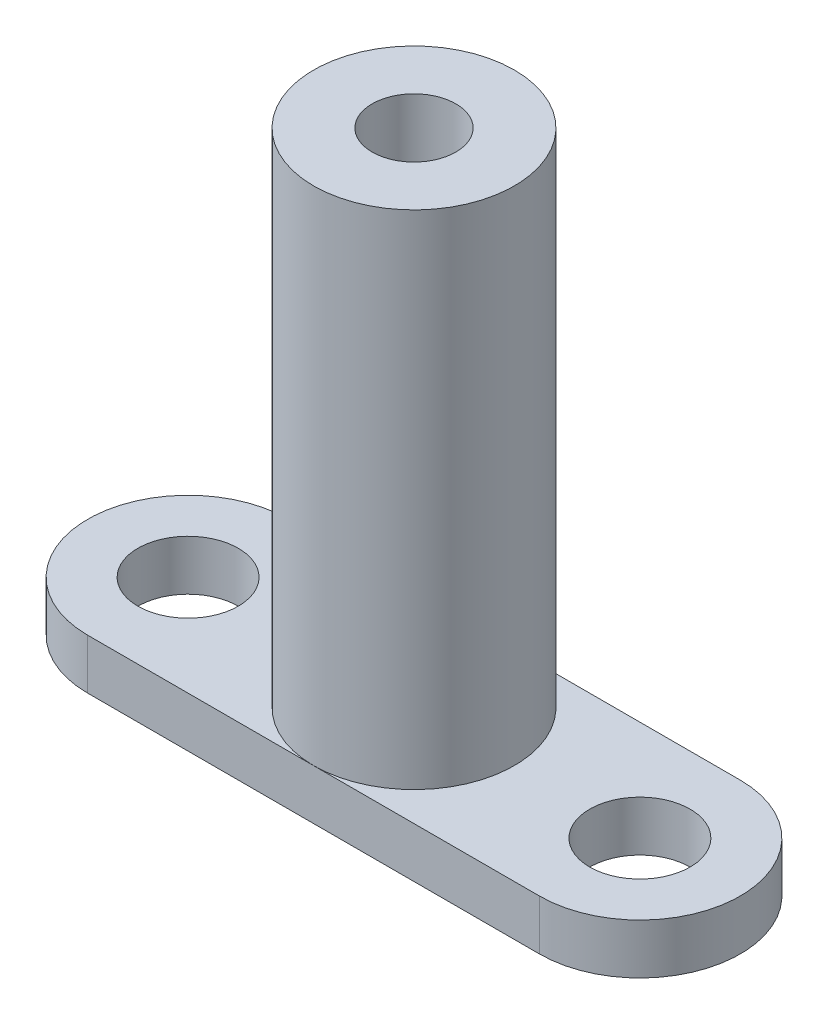
ISO-10303-21;
HEADER;
FILE_DESCRIPTION(('STEP AP214'),'2;1');
FILE_NAME('part.step','',(''),(''),'','','');
FILE_SCHEMA(('AUTOMOTIVE_DESIGN { 1 0 10303 214 1 1 1 1 }'));
ENDSEC;
DATA;
#1=APPLICATION_CONTEXT('core data for automotive mechanical design processes');
#2=APPLICATION_PROTOCOL_DEFINITION('international standard','automotive_design',2000,#1);
#3=PRODUCT_CONTEXT('',#1,'mechanical');
#4=PRODUCT('Part','Part','',(#3));
#5=PRODUCT_RELATED_PRODUCT_CATEGORY('part','',(#4));
#6=PRODUCT_DEFINITION_FORMATION('','',#4);
#7=PRODUCT_DEFINITION_CONTEXT('part definition',#1,'design');
#8=PRODUCT_DEFINITION('design','',#6,#7);
#9=PRODUCT_DEFINITION_SHAPE('','',#8);
#10=(LENGTH_UNIT() NAMED_UNIT(*) SI_UNIT(.MILLI.,.METRE.));
#11=(NAMED_UNIT(*) PLANE_ANGLE_UNIT() SI_UNIT($,.RADIAN.));
#12=(NAMED_UNIT(*) SI_UNIT($,.STERADIAN.) SOLID_ANGLE_UNIT());
#13=UNCERTAINTY_MEASURE_WITH_UNIT(LENGTH_MEASURE(1.E-05),#10,'distance_accuracy_value','');
#14=(GEOMETRIC_REPRESENTATION_CONTEXT(3) GLOBAL_UNCERTAINTY_ASSIGNED_CONTEXT((#13)) GLOBAL_UNIT_ASSIGNED_CONTEXT((#10,
#11,#12)) REPRESENTATION_CONTEXT('',''));
#15=CARTESIAN_POINT('',(0.,0.,0.));
#16=DIRECTION('',(0.,0.,1.));
#17=DIRECTION('',(1.,0.,0.));
#18=AXIS2_PLACEMENT_3D('',#15,#16,#17);
#19=CARTESIAN_POINT('',(0.,3.,0.));
#20=DIRECTION('',(0.,1.,0.));
#21=DIRECTION('',(0.,0.,1.));
#22=AXIS2_PLACEMENT_3D('',#19,#20,#21);
#23=PLANE('',#22);
#24=CARTESIAN_POINT('',(13.5,3.,0.));
#25=DIRECTION('',(0.,1.,0.));
#26=DIRECTION('',(0.,0.,1.));
#27=AXIS2_PLACEMENT_3D('',#24,#25,#26);
#28=CIRCLE('',#27,3.);
#29=CARTESIAN_POINT('',(13.5,3.,3.));
#30=VERTEX_POINT('',#29);
#31=EDGE_CURVE('E151',#30,#30,#28,.T.);
#32=ORIENTED_EDGE('',*,*,#31,.F.);
#33=EDGE_LOOP('',(#32));
#34=FACE_BOUND('',#33,.T.);
#35=CARTESIAN_POINT('',(0.,3.,0.));
#36=DIRECTION('',(0.,1.,0.));
#37=DIRECTION('',(0.,0.,1.));
#38=AXIS2_PLACEMENT_3D('',#35,#36,#37);
#39=CIRCLE('',#38,6.);
#40=CARTESIAN_POINT('',(0.,3.,6.));
#41=VERTEX_POINT('',#40);
#42=CARTESIAN_POINT('',(0.,3.,-6.));
#43=VERTEX_POINT('',#42);
#44=EDGE_CURVE('E52',#41,#43,#39,.T.);
#45=ORIENTED_EDGE('',*,*,#44,.F.);
#46=DIRECTION('',(1.,0.,0.));
#47=VECTOR('',#46,1.);
#48=CARTESIAN_POINT('',(0.,3.,6.));
#49=LINE('',#48,#47);
#50=CARTESIAN_POINT('',(13.5,3.,6.));
#51=VERTEX_POINT('',#50);
#52=EDGE_CURVE('E100',#41,#51,#49,.T.);
#53=ORIENTED_EDGE('',*,*,#52,.T.);
#54=CARTESIAN_POINT('',(13.5,3.,0.));
#55=DIRECTION('',(0.,1.,0.));
#56=DIRECTION('',(0.,0.,1.));
#57=AXIS2_PLACEMENT_3D('',#54,#55,#56);
#58=CIRCLE('',#57,6.);
#59=CARTESIAN_POINT('',(13.5,3.,-6.));
#60=VERTEX_POINT('',#59);
#61=EDGE_CURVE('E99',#51,#60,#58,.T.);
#62=ORIENTED_EDGE('',*,*,#61,.T.);
#63=DIRECTION('',(1.,0.,0.));
#64=VECTOR('',#63,1.);
#65=CARTESIAN_POINT('',(0.,3.,-6.));
#66=LINE('',#65,#64);
#67=EDGE_CURVE('E111',#43,#60,#66,.T.);
#68=ORIENTED_EDGE('',*,*,#67,.F.);
#69=EDGE_LOOP('',(#45,#53,#62,#68));
#70=FACE_BOUND('',#69,.T.);
#71=ADVANCED_FACE('F41',(#34,#70),#23,.T.);
#72=CARTESIAN_POINT('',(-13.5,3.,0.));
#73=DIRECTION('',(0.,-1.,0.));
#74=DIRECTION('',(0.,0.,-1.));
#75=AXIS2_PLACEMENT_3D('',#72,#73,#74);
#76=CYLINDRICAL_SURFACE('',#75,6.);
#77=CARTESIAN_POINT('',(-13.5,0.,0.));
#78=DIRECTION('',(0.,1.,0.));
#79=DIRECTION('',(0.,0.,1.));
#80=AXIS2_PLACEMENT_3D('',#77,#78,#79);
#81=CIRCLE('',#80,6.);
#82=CARTESIAN_POINT('',(-13.5,0.,-6.));
#83=VERTEX_POINT('',#82);
#84=CARTESIAN_POINT('',(-13.5,0.,6.));
#85=VERTEX_POINT('',#84);
#86=EDGE_CURVE('E163',#83,#85,#81,.T.);
#87=ORIENTED_EDGE('',*,*,#86,.T.);
#88=DIRECTION('',(0.,-1.,0.));
#89=VECTOR('',#88,1.);
#90=CARTESIAN_POINT('',(-13.5,3.,6.));
#91=LINE('',#90,#89);
#92=CARTESIAN_POINT('',(-13.5,3.,6.));
#93=VERTEX_POINT('',#92);
#94=EDGE_CURVE('E50',#93,#85,#91,.T.);
#95=ORIENTED_EDGE('',*,*,#94,.F.);
#96=CARTESIAN_POINT('',(-13.5,3.,0.));
#97=DIRECTION('',(0.,1.,0.));
#98=DIRECTION('',(0.,0.,1.));
#99=AXIS2_PLACEMENT_3D('',#96,#97,#98);
#100=CIRCLE('',#99,6.);
#101=CARTESIAN_POINT('',(-13.5,3.,-6.));
#102=VERTEX_POINT('',#101);
#103=EDGE_CURVE('E97',#102,#93,#100,.T.);
#104=ORIENTED_EDGE('',*,*,#103,.F.);
#105=DIRECTION('',(0.,-1.,0.));
#106=VECTOR('',#105,1.);
#107=CARTESIAN_POINT('',(-13.5,3.,-6.));
#108=LINE('',#107,#106);
#109=EDGE_CURVE('E66',#102,#83,#108,.T.);
#110=ORIENTED_EDGE('',*,*,#109,.T.);
#111=EDGE_LOOP('',(#87,#95,#104,#110));
#112=FACE_BOUND('',#111,.T.);
#113=ADVANCED_FACE('F43',(#112),#76,.T.);
#114=CARTESIAN_POINT('',(0.,3.,6.));
#115=DIRECTION('',(0.,0.,-1.));
#116=DIRECTION('',(-1.,0.,0.));
#117=AXIS2_PLACEMENT_3D('',#114,#115,#116);
#118=PLANE('',#117);
#119=DIRECTION('',(1.,0.,0.));
#120=VECTOR('',#119,1.);
#121=CARTESIAN_POINT('',(0.,0.,6.));
#122=LINE('',#121,#120);
#123=CARTESIAN_POINT('',(13.5,0.,6.));
#124=VERTEX_POINT('',#123);
#125=EDGE_CURVE('E171',#85,#124,#122,.T.);
#126=ORIENTED_EDGE('',*,*,#125,.T.);
#127=DIRECTION('',(0.,-1.,0.));
#128=VECTOR('',#127,1.);
#129=CARTESIAN_POINT('',(13.5,3.,6.));
#130=LINE('',#129,#128);
#131=EDGE_CURVE('E106',#51,#124,#130,.T.);
#132=ORIENTED_EDGE('',*,*,#131,.F.);
#133=ORIENTED_EDGE('',*,*,#52,.F.);
#134=EDGE_CURVE('E92',#93,#41,#49,.T.);
#135=ORIENTED_EDGE('',*,*,#134,.F.);
#136=ORIENTED_EDGE('',*,*,#94,.T.);
#137=EDGE_LOOP('',(#126,#132,#133,#135,#136));
#138=FACE_BOUND('',#137,.T.);
#139=ADVANCED_FACE('F104',(#138),#118,.F.);
#140=CARTESIAN_POINT('',(13.5,3.,0.));
#141=DIRECTION('',(0.,-1.,0.));
#142=DIRECTION('',(0.,0.,-1.));
#143=AXIS2_PLACEMENT_3D('',#140,#141,#142);
#144=CYLINDRICAL_SURFACE('',#143,6.);
#145=CARTESIAN_POINT('',(13.5,0.,0.));
#146=DIRECTION('',(0.,1.,0.));
#147=DIRECTION('',(0.,0.,1.));
#148=AXIS2_PLACEMENT_3D('',#145,#146,#147);
#149=CIRCLE('',#148,6.);
#150=CARTESIAN_POINT('',(13.5,0.,-6.));
#151=VERTEX_POINT('',#150);
#152=EDGE_CURVE('E173',#124,#151,#149,.T.);
#153=ORIENTED_EDGE('',*,*,#152,.T.);
#154=DIRECTION('',(0.,-1.,0.));
#155=VECTOR('',#154,1.);
#156=CARTESIAN_POINT('',(13.5,3.,-6.));
#157=LINE('',#156,#155);
#158=EDGE_CURVE('E179',#60,#151,#157,.T.);
#159=ORIENTED_EDGE('',*,*,#158,.F.);
#160=ORIENTED_EDGE('',*,*,#61,.F.);
#161=ORIENTED_EDGE('',*,*,#131,.T.);
#162=EDGE_LOOP('',(#153,#159,#160,#161));
#163=FACE_BOUND('',#162,.T.);
#164=ADVANCED_FACE('F144',(#163),#144,.T.);
#165=CARTESIAN_POINT('',(0.,3.,-6.));
#166=DIRECTION('',(0.,0.,-1.));
#167=DIRECTION('',(-1.,0.,0.));
#168=AXIS2_PLACEMENT_3D('',#165,#166,#167);
#169=PLANE('',#168);
#170=DIRECTION('',(1.,0.,0.));
#171=VECTOR('',#170,1.);
#172=CARTESIAN_POINT('',(0.,0.,-6.));
#173=LINE('',#172,#171);
#174=EDGE_CURVE('E165',#83,#151,#173,.T.);
#175=ORIENTED_EDGE('',*,*,#174,.F.);
#176=ORIENTED_EDGE('',*,*,#109,.F.);
#177=EDGE_CURVE('E168',#102,#43,#66,.T.);
#178=ORIENTED_EDGE('',*,*,#177,.T.);
#179=ORIENTED_EDGE('',*,*,#67,.T.);
#180=ORIENTED_EDGE('',*,*,#158,.T.);
#181=EDGE_LOOP('',(#175,#176,#178,#179,#180));
#182=FACE_BOUND('',#181,.T.);
#183=ADVANCED_FACE('F139',(#182),#169,.T.);
#184=CARTESIAN_POINT('',(-13.5,3.,0.));
#185=DIRECTION('',(0.,1.,0.));
#186=DIRECTION('',(0.,0.,1.));
#187=AXIS2_PLACEMENT_3D('',#184,#185,#186);
#188=CIRCLE('',#187,3.);
#189=CARTESIAN_POINT('',(-13.5,3.,3.));
#190=VERTEX_POINT('',#189);
#191=EDGE_CURVE('E148',#190,#190,#188,.T.);
#192=ORIENTED_EDGE('',*,*,#191,.F.);
#193=EDGE_LOOP('',(#192));
#194=FACE_BOUND('',#193,.T.);
#195=EDGE_CURVE('E11',#43,#41,#39,.T.);
#196=ORIENTED_EDGE('',*,*,#195,.F.);
#197=ORIENTED_EDGE('',*,*,#177,.F.);
#198=ORIENTED_EDGE('',*,*,#103,.T.);
#199=ORIENTED_EDGE('',*,*,#134,.T.);
#200=EDGE_LOOP('',(#196,#197,#198,#199));
#201=FACE_BOUND('',#200,.T.);
#202=ADVANCED_FACE('F96',(#194,#201),#23,.T.);
#203=CARTESIAN_POINT('',(0.,0.,0.));
#204=DIRECTION('',(0.,1.,0.));
#205=DIRECTION('',(0.,0.,1.));
#206=AXIS2_PLACEMENT_3D('',#203,#204,#205);
#207=PLANE('',#206);
#208=CARTESIAN_POINT('',(-13.5,0.,0.));
#209=DIRECTION('',(0.,1.,0.));
#210=DIRECTION('',(0.,0.,1.));
#211=AXIS2_PLACEMENT_3D('',#208,#209,#210);
#212=CIRCLE('',#211,3.);
#213=CARTESIAN_POINT('',(-13.5,0.,3.));
#214=VERTEX_POINT('',#213);
#215=EDGE_CURVE('E45',#214,#214,#212,.T.);
#216=ORIENTED_EDGE('',*,*,#215,.T.);
#217=EDGE_LOOP('',(#216));
#218=FACE_BOUND('',#217,.T.);
#219=CARTESIAN_POINT('',(13.5,0.,0.));
#220=DIRECTION('',(0.,1.,0.));
#221=DIRECTION('',(0.,0.,1.));
#222=AXIS2_PLACEMENT_3D('',#219,#220,#221);
#223=CIRCLE('',#222,3.);
#224=CARTESIAN_POINT('',(13.5,0.,3.));
#225=VERTEX_POINT('',#224);
#226=EDGE_CURVE('E150',#225,#225,#223,.T.);
#227=ORIENTED_EDGE('',*,*,#226,.T.);
#228=EDGE_LOOP('',(#227));
#229=FACE_BOUND('',#228,.T.);
#230=CARTESIAN_POINT('',(0.,0.,0.));
#231=DIRECTION('',(0.,1.,0.));
#232=DIRECTION('',(0.,0.,1.));
#233=AXIS2_PLACEMENT_3D('',#230,#231,#232);
#234=CIRCLE('',#233,2.49999999999999);
#235=CARTESIAN_POINT('',(0.,0.,2.49999999999999));
#236=VERTEX_POINT('',#235);
#237=EDGE_CURVE('E114',#236,#236,#234,.T.);
#238=ORIENTED_EDGE('',*,*,#237,.T.);
#239=EDGE_LOOP('',(#238));
#240=FACE_BOUND('',#239,.T.);
#241=ORIENTED_EDGE('',*,*,#86,.F.);
#242=ORIENTED_EDGE('',*,*,#174,.T.);
#243=ORIENTED_EDGE('',*,*,#152,.F.);
#244=ORIENTED_EDGE('',*,*,#125,.F.);
#245=EDGE_LOOP('',(#241,#242,#243,#244));
#246=FACE_BOUND('',#245,.T.);
#247=ADVANCED_FACE('F118',(#218,#229,#240,#246),#207,.F.);
#248=CARTESIAN_POINT('',(0.,33.,0.));
#249=DIRECTION('',(0.,-1.,0.));
#250=DIRECTION('',(0.,0.,-1.));
#251=AXIS2_PLACEMENT_3D('',#248,#249,#250);
#252=CYLINDRICAL_SURFACE('',#251,6.);
#253=CARTESIAN_POINT('',(0.,33.,0.));
#254=DIRECTION('',(0.,1.,0.));
#255=DIRECTION('',(0.,0.,1.));
#256=AXIS2_PLACEMENT_3D('',#253,#254,#255);
#257=CIRCLE('',#256,6.);
#258=CARTESIAN_POINT('',(0.,33.,6.));
#259=VERTEX_POINT('',#258);
#260=EDGE_CURVE('E113',#259,#259,#257,.T.);
#261=ORIENTED_EDGE('',*,*,#260,.F.);
#262=EDGE_LOOP('',(#261));
#263=FACE_BOUND('',#262,.T.);
#264=ORIENTED_EDGE('',*,*,#44,.T.);
#265=ORIENTED_EDGE('',*,*,#195,.T.);
#266=EDGE_LOOP('',(#264,#265));
#267=FACE_BOUND('',#266,.T.);
#268=ADVANCED_FACE('F115',(#263,#267),#252,.T.);
#269=CARTESIAN_POINT('',(0.,33.,0.));
#270=DIRECTION('',(0.,1.,0.));
#271=DIRECTION('',(0.,0.,1.));
#272=AXIS2_PLACEMENT_3D('',#269,#270,#271);
#273=PLANE('',#272);
#274=CARTESIAN_POINT('',(0.,33.,0.));
#275=DIRECTION('',(0.,1.,0.));
#276=DIRECTION('',(0.,0.,1.));
#277=AXIS2_PLACEMENT_3D('',#274,#275,#276);
#278=CIRCLE('',#277,2.5);
#279=CARTESIAN_POINT('',(0.,33.,2.5));
#280=VERTEX_POINT('',#279);
#281=EDGE_CURVE('E157',#280,#280,#278,.T.);
#282=ORIENTED_EDGE('',*,*,#281,.F.);
#283=EDGE_LOOP('',(#282));
#284=FACE_BOUND('',#283,.T.);
#285=ORIENTED_EDGE('',*,*,#260,.T.);
#286=EDGE_LOOP('',(#285));
#287=FACE_BOUND('',#286,.T.);
#288=ADVANCED_FACE('F117',(#284,#287),#273,.T.);
#289=CARTESIAN_POINT('',(0.,33.,0.));
#290=DIRECTION('',(0.,1.,0.));
#291=DIRECTION('',(0.,0.,1.));
#292=AXIS2_PLACEMENT_3D('',#289,#290,#291);
#293=CYLINDRICAL_SURFACE('',#292,2.5);
#294=ORIENTED_EDGE('',*,*,#237,.F.);
#295=EDGE_LOOP('',(#294));
#296=FACE_BOUND('',#295,.T.);
#297=ORIENTED_EDGE('',*,*,#281,.T.);
#298=EDGE_LOOP('',(#297));
#299=FACE_BOUND('',#298,.T.);
#300=ADVANCED_FACE('F125',(#296,#299),#293,.F.);
#301=CARTESIAN_POINT('',(13.5,-7.,0.));
#302=DIRECTION('',(0.,1.,0.));
#303=DIRECTION('',(0.,0.,1.));
#304=AXIS2_PLACEMENT_3D('',#301,#302,#303);
#305=CYLINDRICAL_SURFACE('',#304,3.);
#306=ORIENTED_EDGE('',*,*,#31,.T.);
#307=EDGE_LOOP('',(#306));
#308=FACE_BOUND('',#307,.T.);
#309=ORIENTED_EDGE('',*,*,#226,.F.);
#310=EDGE_LOOP('',(#309));
#311=FACE_BOUND('',#310,.T.);
#312=ADVANCED_FACE('F260',(#308,#311),#305,.F.);
#313=CARTESIAN_POINT('',(-13.5,-7.,0.));
#314=DIRECTION('',(0.,1.,0.));
#315=DIRECTION('',(0.,0.,1.));
#316=AXIS2_PLACEMENT_3D('',#313,#314,#315);
#317=CYLINDRICAL_SURFACE('',#316,3.);
#318=ORIENTED_EDGE('',*,*,#191,.T.);
#319=EDGE_LOOP('',(#318));
#320=FACE_BOUND('',#319,.T.);
#321=ORIENTED_EDGE('',*,*,#215,.F.);
#322=EDGE_LOOP('',(#321));
#323=FACE_BOUND('',#322,.T.);
#324=ADVANCED_FACE('F269',(#320,#323),#317,.F.);
#325=CLOSED_SHELL('',(#71,#113,#139,#164,#183,#202,#247,#268,#288,#300,#312,#324));
#326=MANIFOLD_SOLID_BREP('B2',#325);
#327=ADVANCED_BREP_SHAPE_REPRESENTATION('',(#18,#326),#14);
#328=SHAPE_DEFINITION_REPRESENTATION(#9,#327);
ENDSEC;
END-ISO-10303-21;
